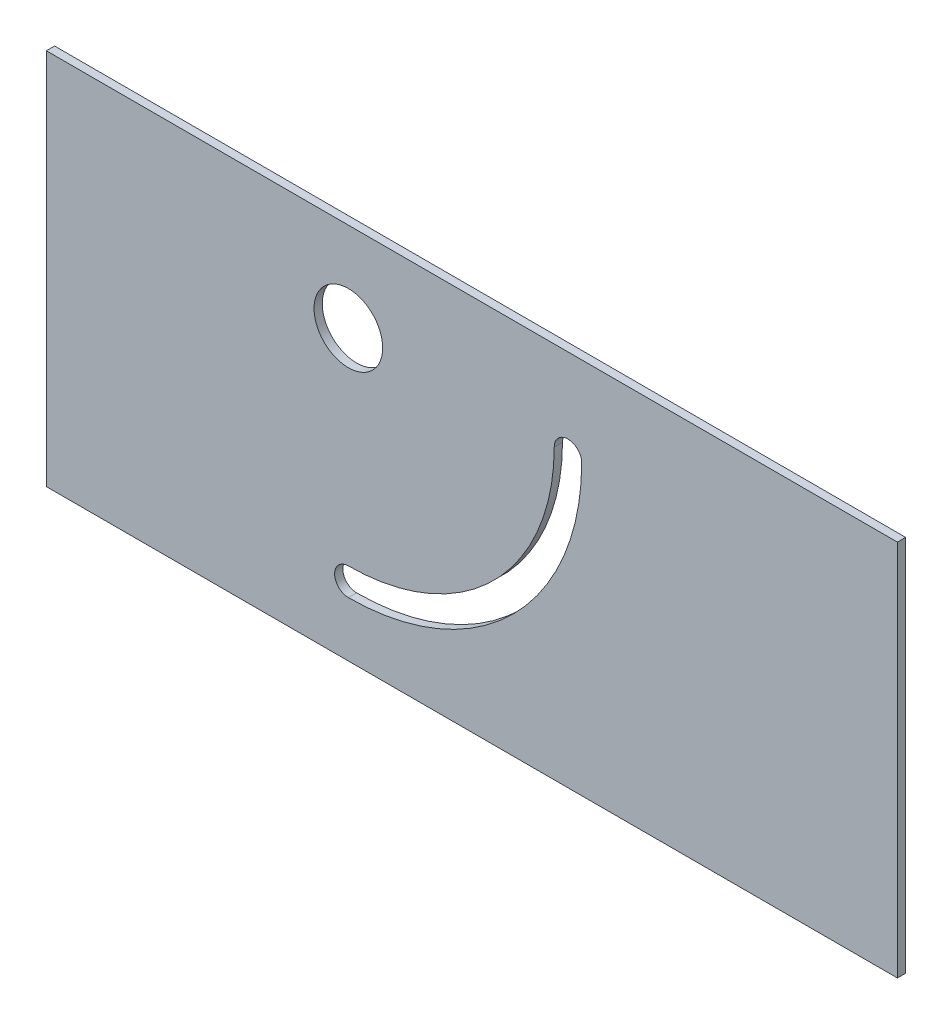
ISO-10303-21;
HEADER;
FILE_DESCRIPTION(('STEP AP214'),'2;1');
FILE_NAME('part.step','',(''),(''),'','','');
FILE_SCHEMA(('AUTOMOTIVE_DESIGN { 1 0 10303 214 1 1 1 1 }'));
ENDSEC;
DATA;
#1=APPLICATION_CONTEXT('core data for automotive mechanical design processes');
#2=APPLICATION_PROTOCOL_DEFINITION('international standard','automotive_design',2000,#1);
#3=PRODUCT_CONTEXT('',#1,'mechanical');
#4=PRODUCT('Part','Part','',(#3));
#5=PRODUCT_RELATED_PRODUCT_CATEGORY('part','',(#4));
#6=PRODUCT_DEFINITION_FORMATION('','',#4);
#7=PRODUCT_DEFINITION_CONTEXT('part definition',#1,'design');
#8=PRODUCT_DEFINITION('design','',#6,#7);
#9=PRODUCT_DEFINITION_SHAPE('','',#8);
#10=(LENGTH_UNIT() NAMED_UNIT(*) SI_UNIT(.MILLI.,.METRE.));
#11=(NAMED_UNIT(*) PLANE_ANGLE_UNIT() SI_UNIT($,.RADIAN.));
#12=(NAMED_UNIT(*) SI_UNIT($,.STERADIAN.) SOLID_ANGLE_UNIT());
#13=UNCERTAINTY_MEASURE_WITH_UNIT(LENGTH_MEASURE(1.E-05),#10,'distance_accuracy_value','');
#14=(GEOMETRIC_REPRESENTATION_CONTEXT(3) GLOBAL_UNCERTAINTY_ASSIGNED_CONTEXT((#13)) GLOBAL_UNIT_ASSIGNED_CONTEXT((#10,
#11,#12)) REPRESENTATION_CONTEXT('',''));
#15=CARTESIAN_POINT('',(0.,0.,0.));
#16=DIRECTION('',(0.,0.,1.));
#17=DIRECTION('',(1.,0.,0.));
#18=AXIS2_PLACEMENT_3D('',#15,#16,#17);
#19=CARTESIAN_POINT('',(0.,0.,-3.));
#20=DIRECTION('',(0.,0.,-1.));
#21=DIRECTION('',(1.,0.,0.));
#22=AXIS2_PLACEMENT_3D('',#19,#20,#21);
#23=PLANE('',#22);
#24=CARTESIAN_POINT('',(84.4999999999886,25.,-3.));
#25=DIRECTION('',(0.,0.,1.));
#26=DIRECTION('',(-1.,0.,0.));
#27=AXIS2_PLACEMENT_3D('',#24,#25,#26);
#28=CIRCLE('',#27,5.);
#29=CARTESIAN_POINT('',(84.4999999999886,30.,-3.));
#30=VERTEX_POINT('',#29);
#31=CARTESIAN_POINT('',(84.4999999999886,20.,-3.));
#32=VERTEX_POINT('',#31);
#33=EDGE_CURVE('E118',#30,#32,#28,.T.);
#34=ORIENTED_EDGE('',*,*,#33,.T.);
#35=CARTESIAN_POINT('',(84.4999999999886,105.,-3.));
#36=DIRECTION('',(0.,0.,1.));
#37=DIRECTION('',(-1.,0.,0.));
#38=AXIS2_PLACEMENT_3D('',#35,#36,#37);
#39=CIRCLE('',#38,84.9999999999998);
#40=CARTESIAN_POINT('',(169.499999999988,105.,-3.));
#41=VERTEX_POINT('',#40);
#42=EDGE_CURVE('E123',#32,#41,#39,.T.);
#43=ORIENTED_EDGE('',*,*,#42,.T.);
#44=CARTESIAN_POINT('',(164.499999999988,105.,-3.));
#45=DIRECTION('',(0.,0.,1.));
#46=DIRECTION('',(1.,0.,0.));
#47=AXIS2_PLACEMENT_3D('',#44,#45,#46);
#48=CIRCLE('',#47,4.99999999999999);
#49=CARTESIAN_POINT('',(159.499999999988,105.,-3.));
#50=VERTEX_POINT('',#49);
#51=EDGE_CURVE('E119',#41,#50,#48,.T.);
#52=ORIENTED_EDGE('',*,*,#51,.T.);
#53=CARTESIAN_POINT('',(84.4999999999886,105.,-3.));
#54=DIRECTION('',(0.,0.,-1.));
#55=DIRECTION('',(-1.,0.,0.));
#56=AXIS2_PLACEMENT_3D('',#53,#54,#55);
#57=CIRCLE('',#56,74.9999999999998);
#58=EDGE_CURVE('E103',#50,#30,#57,.T.);
#59=ORIENTED_EDGE('',*,*,#58,.T.);
#60=EDGE_LOOP('',(#34,#43,#52,#59));
#61=FACE_BOUND('',#60,.T.);
#62=DIRECTION('',(0.,-1.,0.));
#63=VECTOR('',#62,1.);
#64=CARTESIAN_POINT('',(-25.5000000000114,137.499999999999,-3.));
#65=LINE('',#64,#63);
#66=CARTESIAN_POINT('',(-25.5000000000114,137.499999999999,-3.));
#67=VERTEX_POINT('',#66);
#68=CARTESIAN_POINT('',(-25.5000000000114,0.,-3.));
#69=VERTEX_POINT('',#68);
#70=EDGE_CURVE('E139',#67,#69,#65,.T.);
#71=ORIENTED_EDGE('',*,*,#70,.F.);
#72=DIRECTION('',(-1.,0.,0.));
#73=VECTOR('',#72,1.);
#74=CARTESIAN_POINT('',(-25.5000000000114,137.499999999999,-3.));
#75=LINE('',#74,#73);
#76=CARTESIAN_POINT('',(284.499999999988,137.499999999999,-3.));
#77=VERTEX_POINT('',#76);
#78=EDGE_CURVE('E149',#77,#67,#75,.T.);
#79=ORIENTED_EDGE('',*,*,#78,.F.);
#80=DIRECTION('',(0.,1.,0.));
#81=VECTOR('',#80,1.);
#82=CARTESIAN_POINT('',(284.499999999988,137.499999999999,-3.));
#83=LINE('',#82,#81);
#84=CARTESIAN_POINT('',(284.499999999988,0.,-3.));
#85=VERTEX_POINT('',#84);
#86=EDGE_CURVE('E146',#85,#77,#83,.T.);
#87=ORIENTED_EDGE('',*,*,#86,.F.);
#88=DIRECTION('',(1.,0.,0.));
#89=VECTOR('',#88,1.);
#90=CARTESIAN_POINT('',(-25.5000000000114,0.,-3.));
#91=LINE('',#90,#89);
#92=EDGE_CURVE('E142',#69,#85,#91,.T.);
#93=ORIENTED_EDGE('',*,*,#92,.F.);
#94=EDGE_LOOP('',(#71,#79,#87,#93));
#95=FACE_BOUND('',#94,.T.);
#96=CARTESIAN_POINT('',(84.4999999999886,105.,-3.));
#97=DIRECTION('',(0.,0.,1.));
#98=DIRECTION('',(1.,0.,0.));
#99=AXIS2_PLACEMENT_3D('',#96,#97,#98);
#100=CIRCLE('',#99,12.5);
#101=CARTESIAN_POINT('',(96.9999999999886,105.,-3.));
#102=VERTEX_POINT('',#101);
#103=EDGE_CURVE('E131',#102,#102,#100,.T.);
#104=ORIENTED_EDGE('',*,*,#103,.T.);
#105=EDGE_LOOP('',(#104));
#106=FACE_BOUND('',#105,.T.);
#107=ADVANCED_FACE('F37',(#61,#95,#106),#23,.T.);
#108=CARTESIAN_POINT('',(0.,0.,0.));
#109=DIRECTION('',(0.,0.,-1.));
#110=DIRECTION('',(1.,0.,0.));
#111=AXIS2_PLACEMENT_3D('',#108,#109,#110);
#112=PLANE('',#111);
#113=DIRECTION('',(0.,-1.,0.));
#114=VECTOR('',#113,1.);
#115=CARTESIAN_POINT('',(-25.5000000000114,137.499999999999,0.));
#116=LINE('',#115,#114);
#117=CARTESIAN_POINT('',(-25.5000000000114,137.499999999999,0.));
#118=VERTEX_POINT('',#117);
#119=CARTESIAN_POINT('',(-25.5000000000114,0.,0.));
#120=VERTEX_POINT('',#119);
#121=EDGE_CURVE('E111',#118,#120,#116,.T.);
#122=ORIENTED_EDGE('',*,*,#121,.T.);
#123=DIRECTION('',(1.,0.,0.));
#124=VECTOR('',#123,1.);
#125=CARTESIAN_POINT('',(-25.5000000000114,0.,0.));
#126=LINE('',#125,#124);
#127=CARTESIAN_POINT('',(284.499999999988,0.,0.));
#128=VERTEX_POINT('',#127);
#129=EDGE_CURVE('E155',#120,#128,#126,.T.);
#130=ORIENTED_EDGE('',*,*,#129,.T.);
#131=DIRECTION('',(0.,1.,0.));
#132=VECTOR('',#131,1.);
#133=CARTESIAN_POINT('',(284.499999999988,137.499999999999,0.));
#134=LINE('',#133,#132);
#135=CARTESIAN_POINT('',(284.499999999988,137.499999999999,0.));
#136=VERTEX_POINT('',#135);
#137=EDGE_CURVE('E158',#128,#136,#134,.T.);
#138=ORIENTED_EDGE('',*,*,#137,.T.);
#139=DIRECTION('',(-1.,0.,0.));
#140=VECTOR('',#139,1.);
#141=CARTESIAN_POINT('',(-25.5000000000114,137.499999999999,0.));
#142=LINE('',#141,#140);
#143=EDGE_CURVE('E143',#136,#118,#142,.T.);
#144=ORIENTED_EDGE('',*,*,#143,.T.);
#145=EDGE_LOOP('',(#122,#130,#138,#144));
#146=FACE_BOUND('',#145,.T.);
#147=CARTESIAN_POINT('',(84.4999999999886,105.,0.));
#148=DIRECTION('',(0.,0.,-1.));
#149=DIRECTION('',(-1.,0.,0.));
#150=AXIS2_PLACEMENT_3D('',#147,#148,#149);
#151=CIRCLE('',#150,74.9999999999998);
#152=CARTESIAN_POINT('',(159.499999999988,105.,0.));
#153=VERTEX_POINT('',#152);
#154=CARTESIAN_POINT('',(84.4999999999886,30.,0.));
#155=VERTEX_POINT('',#154);
#156=EDGE_CURVE('E106',#153,#155,#151,.T.);
#157=ORIENTED_EDGE('',*,*,#156,.F.);
#158=CARTESIAN_POINT('',(164.499999999988,105.,0.));
#159=DIRECTION('',(0.,0.,1.));
#160=DIRECTION('',(1.,0.,0.));
#161=AXIS2_PLACEMENT_3D('',#158,#159,#160);
#162=CIRCLE('',#161,4.99999999999999);
#163=CARTESIAN_POINT('',(169.499999999988,105.,0.));
#164=VERTEX_POINT('',#163);
#165=EDGE_CURVE('E120',#164,#153,#162,.T.);
#166=ORIENTED_EDGE('',*,*,#165,.F.);
#167=CARTESIAN_POINT('',(84.4999999999886,105.,0.));
#168=DIRECTION('',(0.,0.,1.));
#169=DIRECTION('',(-1.,0.,0.));
#170=AXIS2_PLACEMENT_3D('',#167,#168,#169);
#171=CIRCLE('',#170,84.9999999999998);
#172=CARTESIAN_POINT('',(84.4999999999886,20.,0.));
#173=VERTEX_POINT('',#172);
#174=EDGE_CURVE('E133',#173,#164,#171,.T.);
#175=ORIENTED_EDGE('',*,*,#174,.F.);
#176=CARTESIAN_POINT('',(84.4999999999886,25.,0.));
#177=DIRECTION('',(0.,0.,1.));
#178=DIRECTION('',(-1.,0.,0.));
#179=AXIS2_PLACEMENT_3D('',#176,#177,#178);
#180=CIRCLE('',#179,5.);
#181=EDGE_CURVE('E130',#155,#173,#180,.T.);
#182=ORIENTED_EDGE('',*,*,#181,.F.);
#183=EDGE_LOOP('',(#157,#166,#175,#182));
#184=FACE_BOUND('',#183,.T.);
#185=CARTESIAN_POINT('',(84.4999999999886,105.,0.));
#186=DIRECTION('',(0.,0.,1.));
#187=DIRECTION('',(1.,0.,0.));
#188=AXIS2_PLACEMENT_3D('',#185,#186,#187);
#189=CIRCLE('',#188,12.5);
#190=CARTESIAN_POINT('',(96.9999999999886,105.,0.));
#191=VERTEX_POINT('',#190);
#192=EDGE_CURVE('E218',#191,#191,#189,.T.);
#193=ORIENTED_EDGE('',*,*,#192,.F.);
#194=EDGE_LOOP('',(#193));
#195=FACE_BOUND('',#194,.T.);
#196=ADVANCED_FACE('F175',(#146,#184,#195),#112,.F.);
#197=CARTESIAN_POINT('',(-25.5000000000114,137.499999999999,-3.));
#198=DIRECTION('',(1.,0.,0.));
#199=DIRECTION('',(0.,1.,0.));
#200=AXIS2_PLACEMENT_3D('',#197,#198,#199);
#201=PLANE('',#200);
#202=ORIENTED_EDGE('',*,*,#121,.F.);
#203=DIRECTION('',(0.,0.,1.));
#204=VECTOR('',#203,1.);
#205=CARTESIAN_POINT('',(-25.5000000000114,137.499999999999,-3.));
#206=LINE('',#205,#204);
#207=EDGE_CURVE('E152',#67,#118,#206,.T.);
#208=ORIENTED_EDGE('',*,*,#207,.F.);
#209=ORIENTED_EDGE('',*,*,#70,.T.);
#210=DIRECTION('',(0.,0.,1.));
#211=VECTOR('',#210,1.);
#212=CARTESIAN_POINT('',(-25.5000000000114,0.,-3.));
#213=LINE('',#212,#211);
#214=EDGE_CURVE('E11',#69,#120,#213,.T.);
#215=ORIENTED_EDGE('',*,*,#214,.T.);
#216=EDGE_LOOP('',(#202,#208,#209,#215));
#217=FACE_BOUND('',#216,.T.);
#218=ADVANCED_FACE('F39',(#217),#201,.F.);
#219=CARTESIAN_POINT('',(-25.5000000000114,0.,-3.));
#220=DIRECTION('',(0.,1.,0.));
#221=DIRECTION('',(0.,0.,-1.));
#222=AXIS2_PLACEMENT_3D('',#219,#220,#221);
#223=PLANE('',#222);
#224=ORIENTED_EDGE('',*,*,#129,.F.);
#225=ORIENTED_EDGE('',*,*,#214,.F.);
#226=ORIENTED_EDGE('',*,*,#92,.T.);
#227=DIRECTION('',(0.,0.,1.));
#228=VECTOR('',#227,1.);
#229=CARTESIAN_POINT('',(284.499999999988,0.,-3.));
#230=LINE('',#229,#228);
#231=EDGE_CURVE('E45',#85,#128,#230,.T.);
#232=ORIENTED_EDGE('',*,*,#231,.T.);
#233=EDGE_LOOP('',(#224,#225,#226,#232));
#234=FACE_BOUND('',#233,.T.);
#235=ADVANCED_FACE('F168',(#234),#223,.F.);
#236=CARTESIAN_POINT('',(284.499999999988,137.499999999999,-3.));
#237=DIRECTION('',(-1.,0.,0.));
#238=DIRECTION('',(0.,0.,-1.));
#239=AXIS2_PLACEMENT_3D('',#236,#237,#238);
#240=PLANE('',#239);
#241=ORIENTED_EDGE('',*,*,#137,.F.);
#242=ORIENTED_EDGE('',*,*,#231,.F.);
#243=ORIENTED_EDGE('',*,*,#86,.T.);
#244=DIRECTION('',(0.,0.,1.));
#245=VECTOR('',#244,1.);
#246=CARTESIAN_POINT('',(284.499999999988,137.499999999999,-3.));
#247=LINE('',#246,#245);
#248=EDGE_CURVE('E164',#77,#136,#247,.T.);
#249=ORIENTED_EDGE('',*,*,#248,.T.);
#250=EDGE_LOOP('',(#241,#242,#243,#249));
#251=FACE_BOUND('',#250,.T.);
#252=ADVANCED_FACE('F172',(#251),#240,.F.);
#253=CARTESIAN_POINT('',(-25.5000000000114,137.499999999999,-3.));
#254=DIRECTION('',(0.,-1.,0.));
#255=DIRECTION('',(0.,0.,1.));
#256=AXIS2_PLACEMENT_3D('',#253,#254,#255);
#257=PLANE('',#256);
#258=ORIENTED_EDGE('',*,*,#143,.F.);
#259=ORIENTED_EDGE('',*,*,#248,.F.);
#260=ORIENTED_EDGE('',*,*,#78,.T.);
#261=ORIENTED_EDGE('',*,*,#207,.T.);
#262=EDGE_LOOP('',(#258,#259,#260,#261));
#263=FACE_BOUND('',#262,.T.);
#264=ADVANCED_FACE('F183',(#263),#257,.F.);
#265=CARTESIAN_POINT('',(84.4999999999886,105.,-3.));
#266=DIRECTION('',(0.,0.,1.));
#267=DIRECTION('',(-1.,0.,0.));
#268=AXIS2_PLACEMENT_3D('',#265,#266,#267);
#269=CYLINDRICAL_SURFACE('',#268,74.9999999999998);
#270=ORIENTED_EDGE('',*,*,#156,.T.);
#271=DIRECTION('',(0.,0.,1.));
#272=VECTOR('',#271,1.);
#273=CARTESIAN_POINT('',(84.4999999999886,30.,-3.));
#274=LINE('',#273,#272);
#275=EDGE_CURVE('E100',#30,#155,#274,.T.);
#276=ORIENTED_EDGE('',*,*,#275,.F.);
#277=ORIENTED_EDGE('',*,*,#58,.F.);
#278=DIRECTION('',(0.,0.,1.));
#279=VECTOR('',#278,1.);
#280=CARTESIAN_POINT('',(159.499999999988,105.,-3.));
#281=LINE('',#280,#279);
#282=EDGE_CURVE('E60',#50,#153,#281,.T.);
#283=ORIENTED_EDGE('',*,*,#282,.T.);
#284=EDGE_LOOP('',(#270,#276,#277,#283));
#285=FACE_BOUND('',#284,.T.);
#286=ADVANCED_FACE('F102',(#285),#269,.T.);
#287=CARTESIAN_POINT('',(84.4999999999886,25.,-3.));
#288=DIRECTION('',(0.,0.,1.));
#289=DIRECTION('',(-1.,0.,0.));
#290=AXIS2_PLACEMENT_3D('',#287,#288,#289);
#291=CYLINDRICAL_SURFACE('',#290,5.);
#292=ORIENTED_EDGE('',*,*,#181,.T.);
#293=DIRECTION('',(0.,0.,1.));
#294=VECTOR('',#293,1.);
#295=CARTESIAN_POINT('',(84.4999999999886,20.,-3.));
#296=LINE('',#295,#294);
#297=EDGE_CURVE('E112',#32,#173,#296,.T.);
#298=ORIENTED_EDGE('',*,*,#297,.F.);
#299=ORIENTED_EDGE('',*,*,#33,.F.);
#300=ORIENTED_EDGE('',*,*,#275,.T.);
#301=EDGE_LOOP('',(#292,#298,#299,#300));
#302=FACE_BOUND('',#301,.T.);
#303=ADVANCED_FACE('F122',(#302),#291,.F.);
#304=CARTESIAN_POINT('',(84.4999999999886,105.,-3.));
#305=DIRECTION('',(0.,0.,1.));
#306=DIRECTION('',(-1.,0.,0.));
#307=AXIS2_PLACEMENT_3D('',#304,#305,#306);
#308=CYLINDRICAL_SURFACE('',#307,84.9999999999998);
#309=ORIENTED_EDGE('',*,*,#174,.T.);
#310=DIRECTION('',(0.,0.,1.));
#311=VECTOR('',#310,1.);
#312=CARTESIAN_POINT('',(169.499999999988,105.,-3.));
#313=LINE('',#312,#311);
#314=EDGE_CURVE('E52',#41,#164,#313,.T.);
#315=ORIENTED_EDGE('',*,*,#314,.F.);
#316=ORIENTED_EDGE('',*,*,#42,.F.);
#317=ORIENTED_EDGE('',*,*,#297,.T.);
#318=EDGE_LOOP('',(#309,#315,#316,#317));
#319=FACE_BOUND('',#318,.T.);
#320=ADVANCED_FACE('F201',(#319),#308,.F.);
#321=CARTESIAN_POINT('',(164.499999999988,105.,-3.));
#322=DIRECTION('',(0.,0.,1.));
#323=DIRECTION('',(-1.,0.,0.));
#324=AXIS2_PLACEMENT_3D('',#321,#322,#323);
#325=CYLINDRICAL_SURFACE('',#324,4.99999999999999);
#326=ORIENTED_EDGE('',*,*,#165,.T.);
#327=ORIENTED_EDGE('',*,*,#282,.F.);
#328=ORIENTED_EDGE('',*,*,#51,.F.);
#329=ORIENTED_EDGE('',*,*,#314,.T.);
#330=EDGE_LOOP('',(#326,#327,#328,#329));
#331=FACE_BOUND('',#330,.T.);
#332=ADVANCED_FACE('F204',(#331),#325,.F.);
#333=CARTESIAN_POINT('',(84.4999999999886,105.,-3.));
#334=DIRECTION('',(0.,0.,1.));
#335=DIRECTION('',(-1.,0.,0.));
#336=AXIS2_PLACEMENT_3D('',#333,#334,#335);
#337=CYLINDRICAL_SURFACE('',#336,12.5);
#338=ORIENTED_EDGE('',*,*,#103,.F.);
#339=EDGE_LOOP('',(#338));
#340=FACE_BOUND('',#339,.T.);
#341=ORIENTED_EDGE('',*,*,#192,.T.);
#342=EDGE_LOOP('',(#341));
#343=FACE_BOUND('',#342,.T.);
#344=ADVANCED_FACE('F207',(#340,#343),#337,.F.);
#345=CLOSED_SHELL('',(#107,#196,#218,#235,#252,#264,#286,#303,#320,#332,#344));
#346=MANIFOLD_SOLID_BREP('B2',#345);
#347=ADVANCED_BREP_SHAPE_REPRESENTATION('',(#18,#346),#14);
#348=SHAPE_DEFINITION_REPRESENTATION(#9,#347);
ENDSEC;
END-ISO-10303-21;
